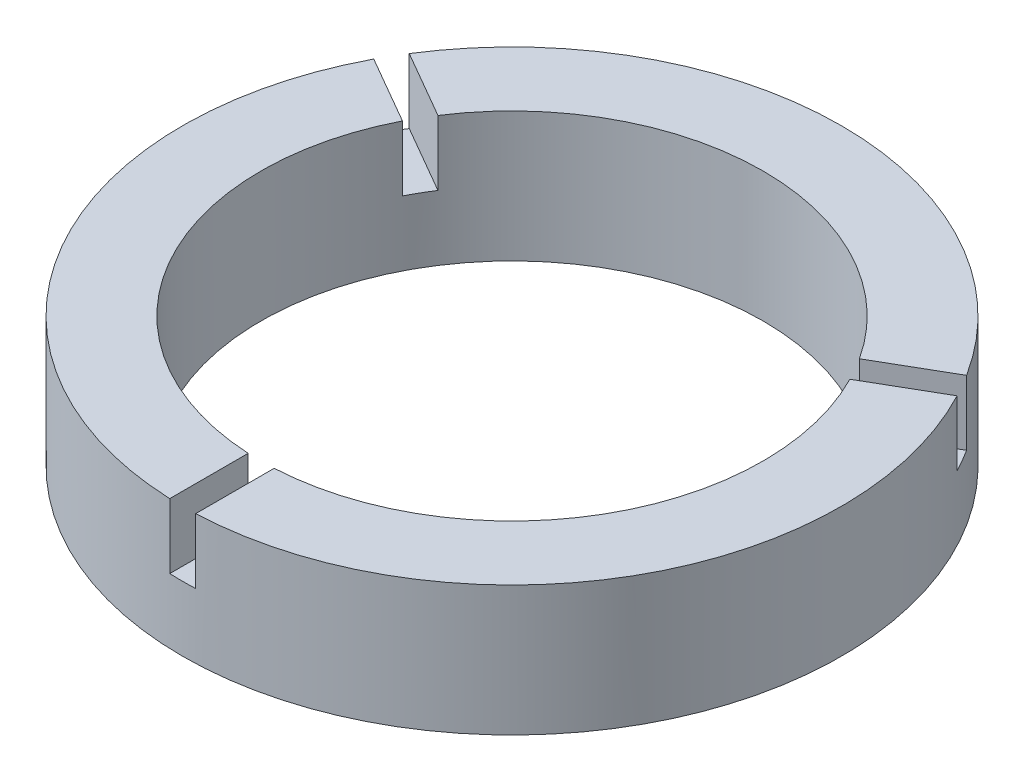
ISO-10303-21;
HEADER;
FILE_DESCRIPTION(('STEP AP214'),'2;1');
FILE_NAME('part.step','',(''),(''),'','','');
FILE_SCHEMA(('AUTOMOTIVE_DESIGN { 1 0 10303 214 1 1 1 1 }'));
ENDSEC;
DATA;
#1=APPLICATION_CONTEXT('core data for automotive mechanical design processes');
#2=APPLICATION_PROTOCOL_DEFINITION('international standard','automotive_design',2000,#1);
#3=PRODUCT_CONTEXT('',#1,'mechanical');
#4=PRODUCT('Part','Part','',(#3));
#5=PRODUCT_RELATED_PRODUCT_CATEGORY('part','',(#4));
#6=PRODUCT_DEFINITION_FORMATION('','',#4);
#7=PRODUCT_DEFINITION_CONTEXT('part definition',#1,'design');
#8=PRODUCT_DEFINITION('design','',#6,#7);
#9=PRODUCT_DEFINITION_SHAPE('','',#8);
#10=(LENGTH_UNIT() NAMED_UNIT(*) SI_UNIT(.MILLI.,.METRE.));
#11=(NAMED_UNIT(*) PLANE_ANGLE_UNIT() SI_UNIT($,.RADIAN.));
#12=(NAMED_UNIT(*) SI_UNIT($,.STERADIAN.) SOLID_ANGLE_UNIT());
#13=UNCERTAINTY_MEASURE_WITH_UNIT(LENGTH_MEASURE(1.E-05),#10,'distance_accuracy_value','');
#14=(GEOMETRIC_REPRESENTATION_CONTEXT(3) GLOBAL_UNCERTAINTY_ASSIGNED_CONTEXT((#13)) GLOBAL_UNIT_ASSIGNED_CONTEXT((#10,
#11,#12)) REPRESENTATION_CONTEXT('',''));
#15=CARTESIAN_POINT('',(0.,0.,0.));
#16=DIRECTION('',(0.,0.,1.));
#17=DIRECTION('',(1.,0.,0.));
#18=AXIS2_PLACEMENT_3D('',#15,#16,#17);
#19=CARTESIAN_POINT('',(0.,15.,0.));
#20=DIRECTION('',(0.,1.,0.));
#21=DIRECTION('',(0.,0.,1.));
#22=AXIS2_PLACEMENT_3D('',#19,#20,#21);
#23=PLANE('',#22);
#24=CARTESIAN_POINT('',(0.,15.,0.));
#25=DIRECTION('',(0.,1.,0.));
#26=DIRECTION('',(0.,0.,1.));
#27=AXIS2_PLACEMENT_3D('',#24,#25,#26);
#28=CIRCLE('',#27,29.);
#29=CARTESIAN_POINT('',(1.5,15.,28.9611809151492));
#30=VERTEX_POINT('',#29);
#31=CARTESIAN_POINT('',(25.8311183961163,15.,-13.1815523518977));
#32=VERTEX_POINT('',#31);
#33=EDGE_CURVE('E214',#30,#32,#28,.T.);
#34=ORIENTED_EDGE('',*,*,#33,.F.);
#35=DIRECTION('',(0.,0.,-1.));
#36=VECTOR('',#35,1.);
#37=CARTESIAN_POINT('',(1.5,15.,20.));
#38=LINE('',#37,#36);
#39=CARTESIAN_POINT('',(1.5,15.,38.0204221438952));
#40=VERTEX_POINT('',#39);
#41=EDGE_CURVE('E220',#30,#40,#38,.F.);
#42=ORIENTED_EDGE('',*,*,#41,.T.);
#43=CARTESIAN_POINT('',(0.,15.,0.));
#44=DIRECTION('',(0.,1.,0.));
#45=DIRECTION('',(0.,0.,1.));
#46=AXIS2_PLACEMENT_3D('',#43,#44,#45);
#47=CIRCLE('',#46,38.05);
#48=CARTESIAN_POINT('',(33.6766514392219,15.,-17.7111729662707));
#49=VERTEX_POINT('',#48);
#50=EDGE_CURVE('E173',#40,#49,#47,.T.);
#51=ORIENTED_EDGE('',*,*,#50,.T.);
#52=DIRECTION('',(0.866025403784443,0.,-0.499999999999992));
#53=VECTOR('',#52,1.);
#54=CARTESIAN_POINT('',(18.0705080756888,15.,-8.70096189432318));
#55=LINE('',#54,#53);
#56=EDGE_CURVE('E222',#32,#49,#55,.T.);
#57=ORIENTED_EDGE('',*,*,#56,.F.);
#58=EDGE_LOOP('',(#34,#42,#51,#57));
#59=FACE_BOUND('',#58,.T.);
#60=ADVANCED_FACE('F75',(#59),#23,.T.);
#61=CARTESIAN_POINT('',(24.3311183961164,15.,-15.779628563251));
#62=VERTEX_POINT('',#61);
#63=CARTESIAN_POINT('',(-24.3311183961162,15.,-15.7796285632513));
#64=VERTEX_POINT('',#63);
#65=EDGE_CURVE('E225',#62,#64,#28,.T.);
#66=ORIENTED_EDGE('',*,*,#65,.F.);
#67=DIRECTION('',(0.866025403784443,0.,-0.499999999999992));
#68=VECTOR('',#67,1.);
#69=CARTESIAN_POINT('',(16.5705080756889,15.,-11.2990381056765));
#70=LINE('',#69,#68);
#71=CARTESIAN_POINT('',(32.1766514392219,15.,-20.309249177624));
#72=VERTEX_POINT('',#71);
#73=EDGE_CURVE('E275',#62,#72,#70,.T.);
#74=ORIENTED_EDGE('',*,*,#73,.T.);
#75=CARTESIAN_POINT('',(-32.1766514392216,15.,-20.3092491776244));
#76=VERTEX_POINT('',#75);
#77=EDGE_CURVE('E247',#72,#76,#47,.T.);
#78=ORIENTED_EDGE('',*,*,#77,.T.);
#79=DIRECTION('',(-0.866025403784436,0.,-0.500000000000004));
#80=VECTOR('',#79,1.);
#81=CARTESIAN_POINT('',(-16.5705080756887,15.,-11.2990381056767));
#82=LINE('',#81,#80);
#83=EDGE_CURVE('E313',#64,#76,#82,.T.);
#84=ORIENTED_EDGE('',*,*,#83,.F.);
#85=EDGE_LOOP('',(#66,#74,#78,#84));
#86=FACE_BOUND('',#85,.T.);
#87=ADVANCED_FACE('F318',(#86),#23,.T.);
#88=DIRECTION('',(0.,0.,-1.));
#89=VECTOR('',#88,1.);
#90=CARTESIAN_POINT('',(-1.5,15.,20.));
#91=LINE('',#90,#89);
#92=CARTESIAN_POINT('',(-1.5,15.,28.9611809151492));
#93=VERTEX_POINT('',#92);
#94=CARTESIAN_POINT('',(-1.5,15.,38.0204221438952));
#95=VERTEX_POINT('',#94);
#96=EDGE_CURVE('E182',#93,#95,#91,.F.);
#97=ORIENTED_EDGE('',*,*,#96,.F.);
#98=CARTESIAN_POINT('',(-25.8311183961162,15.,-13.181552351898));
#99=VERTEX_POINT('',#98);
#100=EDGE_CURVE('E227',#99,#93,#28,.T.);
#101=ORIENTED_EDGE('',*,*,#100,.F.);
#102=DIRECTION('',(-0.866025403784436,0.,-0.500000000000004));
#103=VECTOR('',#102,1.);
#104=CARTESIAN_POINT('',(-18.0705080756887,15.,-8.70096189432343));
#105=LINE('',#104,#103);
#106=CARTESIAN_POINT('',(-33.6766514392216,15.,-17.7111729662711));
#107=VERTEX_POINT('',#106);
#108=EDGE_CURVE('E99',#99,#107,#105,.T.);
#109=ORIENTED_EDGE('',*,*,#108,.T.);
#110=EDGE_CURVE('E231',#107,#95,#47,.T.);
#111=ORIENTED_EDGE('',*,*,#110,.T.);
#112=EDGE_LOOP('',(#97,#101,#109,#111));
#113=FACE_BOUND('',#112,.T.);
#114=ADVANCED_FACE('F255',(#113),#23,.T.);
#115=CARTESIAN_POINT('',(0.,0.,0.));
#116=DIRECTION('',(0.,1.,0.));
#117=DIRECTION('',(0.,0.,1.));
#118=AXIS2_PLACEMENT_3D('',#115,#116,#117);
#119=PLANE('',#118);
#120=CARTESIAN_POINT('',(0.,0.,0.));
#121=DIRECTION('',(0.,1.,0.));
#122=DIRECTION('',(0.,0.,1.));
#123=AXIS2_PLACEMENT_3D('',#120,#121,#122);
#124=CIRCLE('',#123,38.05);
#125=CARTESIAN_POINT('',(0.,0.,38.05));
#126=VERTEX_POINT('',#125);
#127=EDGE_CURVE('E224',#126,#126,#124,.T.);
#128=ORIENTED_EDGE('',*,*,#127,.F.);
#129=EDGE_LOOP('',(#128));
#130=FACE_BOUND('',#129,.T.);
#131=CARTESIAN_POINT('',(0.,0.,0.));
#132=DIRECTION('',(0.,1.,0.));
#133=DIRECTION('',(0.,0.,1.));
#134=AXIS2_PLACEMENT_3D('',#131,#132,#133);
#135=CIRCLE('',#134,29.);
#136=CARTESIAN_POINT('',(0.,0.,29.));
#137=VERTEX_POINT('',#136);
#138=EDGE_CURVE('E236',#137,#137,#135,.T.);
#139=ORIENTED_EDGE('',*,*,#138,.T.);
#140=EDGE_LOOP('',(#139));
#141=FACE_BOUND('',#140,.T.);
#142=ADVANCED_FACE('F348',(#130,#141),#119,.F.);
#143=CARTESIAN_POINT('',(0.,15.,0.));
#144=DIRECTION('',(0.,-1.,0.));
#145=DIRECTION('',(0.,0.,-1.));
#146=AXIS2_PLACEMENT_3D('',#143,#144,#145);
#147=CYLINDRICAL_SURFACE('',#146,38.05);
#148=CARTESIAN_POINT('',(0.,7.5,0.));
#149=DIRECTION('',(0.,1.,0.));
#150=DIRECTION('',(0.,0.,1.));
#151=AXIS2_PLACEMENT_3D('',#148,#149,#150);
#152=CIRCLE('',#151,38.05);
#153=CARTESIAN_POINT('',(-1.5,7.5,38.0204221438952));
#154=VERTEX_POINT('',#153);
#155=CARTESIAN_POINT('',(1.5,7.5,38.0204221438952));
#156=VERTEX_POINT('',#155);
#157=EDGE_CURVE('E261',#154,#156,#152,.T.);
#158=ORIENTED_EDGE('',*,*,#157,.F.);
#159=DIRECTION('',(0.,-1.,0.));
#160=VECTOR('',#159,1.);
#161=CARTESIAN_POINT('',(-1.5,15.,38.0204221438952));
#162=LINE('',#161,#160);
#163=EDGE_CURVE('E239',#154,#95,#162,.F.);
#164=ORIENTED_EDGE('',*,*,#163,.T.);
#165=ORIENTED_EDGE('',*,*,#110,.F.);
#166=DIRECTION('',(0.,-1.,0.));
#167=VECTOR('',#166,1.);
#168=CARTESIAN_POINT('',(-33.6766514392216,15.,-17.7111729662711));
#169=LINE('',#168,#167);
#170=CARTESIAN_POINT('',(-33.6766514392216,7.5,-17.7111729662711));
#171=VERTEX_POINT('',#170);
#172=EDGE_CURVE('E259',#171,#107,#169,.F.);
#173=ORIENTED_EDGE('',*,*,#172,.F.);
#174=CARTESIAN_POINT('',(-32.1766514392216,7.5,-20.3092491776244));
#175=VERTEX_POINT('',#174);
#176=EDGE_CURVE('E180',#175,#171,#152,.T.);
#177=ORIENTED_EDGE('',*,*,#176,.F.);
#178=DIRECTION('',(0.,-1.,0.));
#179=VECTOR('',#178,1.);
#180=CARTESIAN_POINT('',(-32.1766514392216,15.,-20.3092491776244));
#181=LINE('',#180,#179);
#182=EDGE_CURVE('E282',#175,#76,#181,.F.);
#183=ORIENTED_EDGE('',*,*,#182,.T.);
#184=ORIENTED_EDGE('',*,*,#77,.F.);
#185=DIRECTION('',(0.,-1.,0.));
#186=VECTOR('',#185,1.);
#187=CARTESIAN_POINT('',(32.1766514392219,15.,-20.309249177624));
#188=LINE('',#187,#186);
#189=CARTESIAN_POINT('',(32.1766514392219,7.5,-20.309249177624));
#190=VERTEX_POINT('',#189);
#191=EDGE_CURVE('E286',#190,#72,#188,.F.);
#192=ORIENTED_EDGE('',*,*,#191,.F.);
#193=CARTESIAN_POINT('',(33.6766514392219,7.5,-17.7111729662707));
#194=VERTEX_POINT('',#193);
#195=EDGE_CURVE('E295',#194,#190,#152,.T.);
#196=ORIENTED_EDGE('',*,*,#195,.F.);
#197=DIRECTION('',(0.,-1.,0.));
#198=VECTOR('',#197,1.);
#199=CARTESIAN_POINT('',(33.6766514392218,15.,-17.7111729662707));
#200=LINE('',#199,#198);
#201=EDGE_CURVE('E289',#194,#49,#200,.F.);
#202=ORIENTED_EDGE('',*,*,#201,.T.);
#203=ORIENTED_EDGE('',*,*,#50,.F.);
#204=DIRECTION('',(0.,-1.,0.));
#205=VECTOR('',#204,1.);
#206=CARTESIAN_POINT('',(1.5,15.,38.0204221438952));
#207=LINE('',#206,#205);
#208=EDGE_CURVE('E244',#156,#40,#207,.F.);
#209=ORIENTED_EDGE('',*,*,#208,.F.);
#210=EDGE_LOOP('',(#158,#164,#165,#173,#177,#183,#184,#192,#196,#202,#203,#209));
#211=FACE_BOUND('',#210,.T.);
#212=ORIENTED_EDGE('',*,*,#127,.T.);
#213=EDGE_LOOP('',(#212));
#214=FACE_BOUND('',#213,.T.);
#215=ADVANCED_FACE('F77',(#211,#214),#147,.T.);
#216=CARTESIAN_POINT('',(0.,15.,0.));
#217=DIRECTION('',(0.,-1.,0.));
#218=DIRECTION('',(0.,0.,-1.));
#219=AXIS2_PLACEMENT_3D('',#216,#217,#218);
#220=CYLINDRICAL_SURFACE('',#219,29.);
#221=DIRECTION('',(0.,-1.,0.));
#222=VECTOR('',#221,1.);
#223=CARTESIAN_POINT('',(-1.5,15.,28.9611809151492));
#224=LINE('',#223,#222);
#225=CARTESIAN_POINT('',(-1.5,7.5,28.9611809151492));
#226=VERTEX_POINT('',#225);
#227=EDGE_CURVE('E12',#226,#93,#224,.F.);
#228=ORIENTED_EDGE('',*,*,#227,.F.);
#229=CARTESIAN_POINT('',(0.,7.5,0.));
#230=DIRECTION('',(0.,1.,0.));
#231=DIRECTION('',(0.,0.,1.));
#232=AXIS2_PLACEMENT_3D('',#229,#230,#231);
#233=CIRCLE('',#232,29.);
#234=CARTESIAN_POINT('',(1.5,7.5,28.9611809151492));
#235=VERTEX_POINT('',#234);
#236=EDGE_CURVE('E193',#226,#235,#233,.T.);
#237=ORIENTED_EDGE('',*,*,#236,.T.);
#238=DIRECTION('',(0.,-1.,0.));
#239=VECTOR('',#238,1.);
#240=CARTESIAN_POINT('',(1.5,15.,28.9611809151492));
#241=LINE('',#240,#239);
#242=EDGE_CURVE('E84',#235,#30,#241,.F.);
#243=ORIENTED_EDGE('',*,*,#242,.T.);
#244=ORIENTED_EDGE('',*,*,#33,.T.);
#245=DIRECTION('',(0.,-1.,0.));
#246=VECTOR('',#245,1.);
#247=CARTESIAN_POINT('',(25.8311183961163,15.,-13.1815523518977));
#248=LINE('',#247,#246);
#249=CARTESIAN_POINT('',(25.8311183961163,7.5,-13.1815523518977));
#250=VERTEX_POINT('',#249);
#251=EDGE_CURVE('E200',#250,#32,#248,.F.);
#252=ORIENTED_EDGE('',*,*,#251,.F.);
#253=CARTESIAN_POINT('',(24.3311183961164,7.5,-15.779628563251));
#254=VERTEX_POINT('',#253);
#255=EDGE_CURVE('E194',#250,#254,#233,.T.);
#256=ORIENTED_EDGE('',*,*,#255,.T.);
#257=DIRECTION('',(0.,-1.,0.));
#258=VECTOR('',#257,1.);
#259=CARTESIAN_POINT('',(24.3311183961164,15.,-15.779628563251));
#260=LINE('',#259,#258);
#261=EDGE_CURVE('E196',#254,#62,#260,.F.);
#262=ORIENTED_EDGE('',*,*,#261,.T.);
#263=ORIENTED_EDGE('',*,*,#65,.T.);
#264=DIRECTION('',(0.,-1.,0.));
#265=VECTOR('',#264,1.);
#266=CARTESIAN_POINT('',(-24.3311183961162,15.,-15.7796285632513));
#267=LINE('',#266,#265);
#268=CARTESIAN_POINT('',(-24.3311183961162,7.5,-15.7796285632513));
#269=VERTEX_POINT('',#268);
#270=EDGE_CURVE('E190',#269,#64,#267,.F.);
#271=ORIENTED_EDGE('',*,*,#270,.F.);
#272=CARTESIAN_POINT('',(-25.8311183961162,7.5,-13.181552351898));
#273=VERTEX_POINT('',#272);
#274=EDGE_CURVE('E172',#269,#273,#233,.T.);
#275=ORIENTED_EDGE('',*,*,#274,.T.);
#276=DIRECTION('',(0.,-1.,0.));
#277=VECTOR('',#276,1.);
#278=CARTESIAN_POINT('',(-25.8311183961162,15.,-13.181552351898));
#279=LINE('',#278,#277);
#280=EDGE_CURVE('E162',#273,#99,#279,.F.);
#281=ORIENTED_EDGE('',*,*,#280,.T.);
#282=ORIENTED_EDGE('',*,*,#100,.T.);
#283=EDGE_LOOP('',(#228,#237,#243,#244,#252,#256,#262,#263,#271,#275,#281,#282));
#284=FACE_BOUND('',#283,.T.);
#285=ORIENTED_EDGE('',*,*,#138,.F.);
#286=EDGE_LOOP('',(#285));
#287=FACE_BOUND('',#286,.T.);
#288=ADVANCED_FACE('F187',(#284,#287),#220,.F.);
#289=CARTESIAN_POINT('',(-18.0705080756887,7.5,-8.70096189432343));
#290=DIRECTION('',(0.500000000000004,0.,-0.866025403784436));
#291=DIRECTION('',(-0.866025403784436,0.,-0.500000000000004));
#292=AXIS2_PLACEMENT_3D('',#289,#290,#291);
#293=PLANE('',#292);
#294=ORIENTED_EDGE('',*,*,#172,.T.);
#295=ORIENTED_EDGE('',*,*,#108,.F.);
#296=ORIENTED_EDGE('',*,*,#280,.F.);
#297=DIRECTION('',(-0.866025403784436,0.,-0.500000000000004));
#298=VECTOR('',#297,1.);
#299=CARTESIAN_POINT('',(-18.0705080756887,7.5,-8.70096189432343));
#300=LINE('',#299,#298);
#301=EDGE_CURVE('E165',#273,#171,#300,.T.);
#302=ORIENTED_EDGE('',*,*,#301,.T.);
#303=EDGE_LOOP('',(#294,#295,#296,#302));
#304=FACE_BOUND('',#303,.T.);
#305=ADVANCED_FACE('F164',(#304),#293,.T.);
#306=CARTESIAN_POINT('',(-16.5705080756887,7.5,-11.2990381056767));
#307=DIRECTION('',(0.500000000000004,0.,-0.866025403784436));
#308=DIRECTION('',(-0.866025403784436,0.,-0.500000000000004));
#309=AXIS2_PLACEMENT_3D('',#306,#307,#308);
#310=PLANE('',#309);
#311=DIRECTION('',(-0.866025403784436,0.,-0.500000000000004));
#312=VECTOR('',#311,1.);
#313=CARTESIAN_POINT('',(-16.5705080756887,7.5,-11.2990381056767));
#314=LINE('',#313,#312);
#315=EDGE_CURVE('E183',#269,#175,#314,.T.);
#316=ORIENTED_EDGE('',*,*,#315,.F.);
#317=ORIENTED_EDGE('',*,*,#270,.T.);
#318=ORIENTED_EDGE('',*,*,#83,.T.);
#319=ORIENTED_EDGE('',*,*,#182,.F.);
#320=EDGE_LOOP('',(#316,#317,#318,#319));
#321=FACE_BOUND('',#320,.T.);
#322=ADVANCED_FACE('F331',(#321),#310,.F.);
#323=CARTESIAN_POINT('',(0.,7.5,0.));
#324=DIRECTION('',(0.,1.,0.));
#325=DIRECTION('',(1.,0.,0.));
#326=AXIS2_PLACEMENT_3D('',#323,#324,#325);
#327=PLANE('',#326);
#328=ORIENTED_EDGE('',*,*,#176,.T.);
#329=ORIENTED_EDGE('',*,*,#301,.F.);
#330=ORIENTED_EDGE('',*,*,#274,.F.);
#331=ORIENTED_EDGE('',*,*,#315,.T.);
#332=EDGE_LOOP('',(#328,#329,#330,#331));
#333=FACE_BOUND('',#332,.T.);
#334=ADVANCED_FACE('F176',(#333),#327,.T.);
#335=CARTESIAN_POINT('',(16.5705080756889,7.5,-11.2990381056765));
#336=DIRECTION('',(0.499999999999992,0.,0.866025403784443));
#337=DIRECTION('',(0.866025403784443,0.,-0.499999999999992));
#338=AXIS2_PLACEMENT_3D('',#335,#336,#337);
#339=PLANE('',#338);
#340=ORIENTED_EDGE('',*,*,#191,.T.);
#341=ORIENTED_EDGE('',*,*,#73,.F.);
#342=ORIENTED_EDGE('',*,*,#261,.F.);
#343=DIRECTION('',(0.866025403784443,0.,-0.499999999999992));
#344=VECTOR('',#343,1.);
#345=CARTESIAN_POINT('',(16.5705080756889,7.5,-11.2990381056765));
#346=LINE('',#345,#344);
#347=EDGE_CURVE('E305',#254,#190,#346,.T.);
#348=ORIENTED_EDGE('',*,*,#347,.T.);
#349=EDGE_LOOP('',(#340,#341,#342,#348));
#350=FACE_BOUND('',#349,.T.);
#351=ADVANCED_FACE('F310',(#350),#339,.T.);
#352=CARTESIAN_POINT('',(18.0705080756888,7.5,-8.70096189432318));
#353=DIRECTION('',(0.499999999999992,0.,0.866025403784443));
#354=DIRECTION('',(0.866025403784443,0.,-0.499999999999992));
#355=AXIS2_PLACEMENT_3D('',#352,#353,#354);
#356=PLANE('',#355);
#357=DIRECTION('',(0.866025403784443,0.,-0.499999999999992));
#358=VECTOR('',#357,1.);
#359=CARTESIAN_POINT('',(18.0705080756888,7.5,-8.70096189432318));
#360=LINE('',#359,#358);
#361=EDGE_CURVE('E307',#250,#194,#360,.T.);
#362=ORIENTED_EDGE('',*,*,#361,.F.);
#363=ORIENTED_EDGE('',*,*,#251,.T.);
#364=ORIENTED_EDGE('',*,*,#56,.T.);
#365=ORIENTED_EDGE('',*,*,#201,.F.);
#366=EDGE_LOOP('',(#362,#363,#364,#365));
#367=FACE_BOUND('',#366,.T.);
#368=ADVANCED_FACE('F369',(#367),#356,.F.);
#369=ORIENTED_EDGE('',*,*,#195,.T.);
#370=ORIENTED_EDGE('',*,*,#347,.F.);
#371=ORIENTED_EDGE('',*,*,#255,.F.);
#372=ORIENTED_EDGE('',*,*,#361,.T.);
#373=EDGE_LOOP('',(#369,#370,#371,#372));
#374=FACE_BOUND('',#373,.T.);
#375=ADVANCED_FACE('F304',(#374),#327,.T.);
#376=CARTESIAN_POINT('',(-1.5,7.5,20.));
#377=DIRECTION('',(-1.,0.,0.));
#378=DIRECTION('',(0.,0.,1.));
#379=AXIS2_PLACEMENT_3D('',#376,#377,#378);
#380=PLANE('',#379);
#381=DIRECTION('',(0.,0.,-1.));
#382=VECTOR('',#381,1.);
#383=CARTESIAN_POINT('',(-1.5,7.5,20.));
#384=LINE('',#383,#382);
#385=EDGE_CURVE('E266',#226,#154,#384,.F.);
#386=ORIENTED_EDGE('',*,*,#385,.F.);
#387=ORIENTED_EDGE('',*,*,#227,.T.);
#388=ORIENTED_EDGE('',*,*,#96,.T.);
#389=ORIENTED_EDGE('',*,*,#163,.F.);
#390=EDGE_LOOP('',(#386,#387,#388,#389));
#391=FACE_BOUND('',#390,.T.);
#392=ADVANCED_FACE('F265',(#391),#380,.F.);
#393=CARTESIAN_POINT('',(1.5,7.5,20.));
#394=DIRECTION('',(-1.,0.,0.));
#395=DIRECTION('',(0.,0.,1.));
#396=AXIS2_PLACEMENT_3D('',#393,#394,#395);
#397=PLANE('',#396);
#398=ORIENTED_EDGE('',*,*,#208,.T.);
#399=ORIENTED_EDGE('',*,*,#41,.F.);
#400=ORIENTED_EDGE('',*,*,#242,.F.);
#401=DIRECTION('',(0.,0.,-1.));
#402=VECTOR('',#401,1.);
#403=CARTESIAN_POINT('',(1.5,7.5,20.));
#404=LINE('',#403,#402);
#405=EDGE_CURVE('E91',#235,#156,#404,.F.);
#406=ORIENTED_EDGE('',*,*,#405,.T.);
#407=EDGE_LOOP('',(#398,#399,#400,#406));
#408=FACE_BOUND('',#407,.T.);
#409=ADVANCED_FACE('F365',(#408),#397,.T.);
#410=ORIENTED_EDGE('',*,*,#157,.T.);
#411=ORIENTED_EDGE('',*,*,#405,.F.);
#412=ORIENTED_EDGE('',*,*,#236,.F.);
#413=ORIENTED_EDGE('',*,*,#385,.T.);
#414=EDGE_LOOP('',(#410,#411,#412,#413));
#415=FACE_BOUND('',#414,.T.);
#416=ADVANCED_FACE('F267',(#415),#327,.T.);
#417=CLOSED_SHELL('',(#60,#87,#114,#142,#215,#288,#305,#322,#334,#351,#368,#375,#392,#409,#416));
#418=MANIFOLD_SOLID_BREP('B2',#417);
#419=ADVANCED_BREP_SHAPE_REPRESENTATION('',(#18,#418),#14);
#420=SHAPE_DEFINITION_REPRESENTATION(#9,#419);
ENDSEC;
END-ISO-10303-21;
